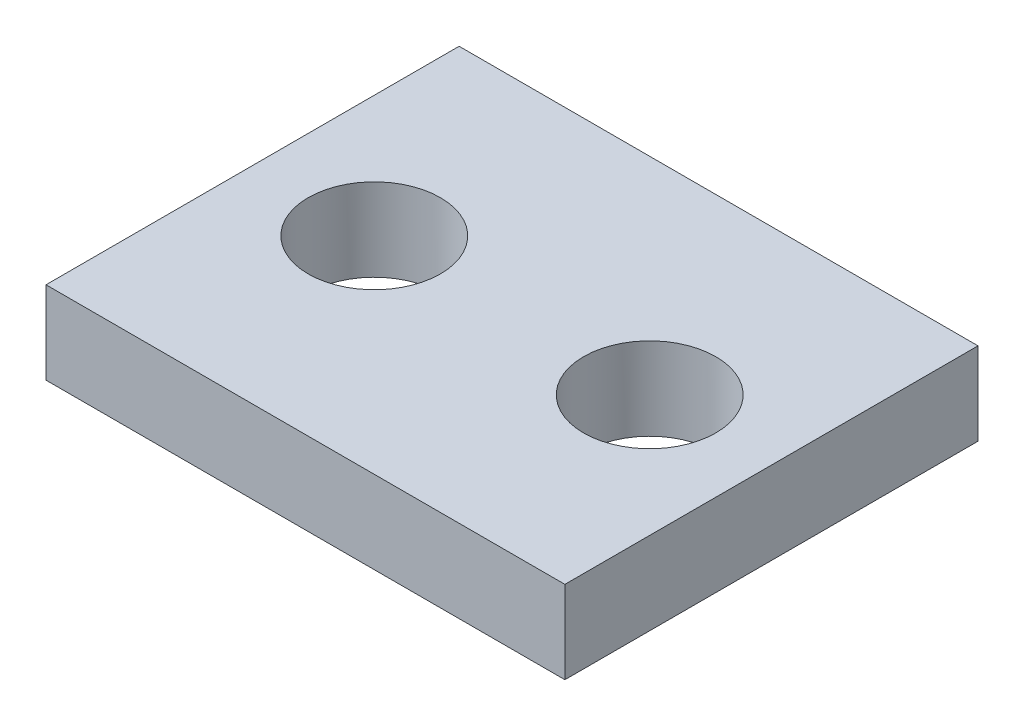
ISO-10303-21;
HEADER;
FILE_DESCRIPTION(('STEP AP214'),'2;1');
FILE_NAME('part.step','',(''),(''),'','','');
FILE_SCHEMA(('AUTOMOTIVE_DESIGN { 1 0 10303 214 1 1 1 1 }'));
ENDSEC;
DATA;
#1=APPLICATION_CONTEXT('core data for automotive mechanical design processes');
#2=APPLICATION_PROTOCOL_DEFINITION('international standard','automotive_design',2000,#1);
#3=PRODUCT_CONTEXT('',#1,'mechanical');
#4=PRODUCT('Part','Part','',(#3));
#5=PRODUCT_RELATED_PRODUCT_CATEGORY('part','',(#4));
#6=PRODUCT_DEFINITION_FORMATION('','',#4);
#7=PRODUCT_DEFINITION_CONTEXT('part definition',#1,'design');
#8=PRODUCT_DEFINITION('design','',#6,#7);
#9=PRODUCT_DEFINITION_SHAPE('','',#8);
#10=(LENGTH_UNIT() NAMED_UNIT(*) SI_UNIT(.MILLI.,.METRE.));
#11=(NAMED_UNIT(*) PLANE_ANGLE_UNIT() SI_UNIT($,.RADIAN.));
#12=(NAMED_UNIT(*) SI_UNIT($,.STERADIAN.) SOLID_ANGLE_UNIT());
#13=UNCERTAINTY_MEASURE_WITH_UNIT(LENGTH_MEASURE(1.E-05),#10,'distance_accuracy_value','');
#14=(GEOMETRIC_REPRESENTATION_CONTEXT(3) GLOBAL_UNCERTAINTY_ASSIGNED_CONTEXT((#13)) GLOBAL_UNIT_ASSIGNED_CONTEXT((#10,
#11,#12)) REPRESENTATION_CONTEXT('',''));
#15=CARTESIAN_POINT('',(0.,0.,0.));
#16=DIRECTION('',(0.,0.,1.));
#17=DIRECTION('',(1.,0.,0.));
#18=AXIS2_PLACEMENT_3D('',#15,#16,#17);
#19=CARTESIAN_POINT('',(9.42,3.,7.5));
#20=DIRECTION('',(-1.,0.,0.));
#21=DIRECTION('',(0.,0.,1.));
#22=AXIS2_PLACEMENT_3D('',#19,#20,#21);
#23=PLANE('',#22);
#24=DIRECTION('',(0.,0.,-1.));
#25=VECTOR('',#24,1.);
#26=CARTESIAN_POINT('',(9.42,0.,7.5));
#27=LINE('',#26,#25);
#28=CARTESIAN_POINT('',(9.42,0.,7.5));
#29=VERTEX_POINT('',#28);
#30=CARTESIAN_POINT('',(9.42,0.,-7.5));
#31=VERTEX_POINT('',#30);
#32=EDGE_CURVE('E96',#29,#31,#27,.T.);
#33=ORIENTED_EDGE('',*,*,#32,.T.);
#34=DIRECTION('',(0.,-1.,0.));
#35=VECTOR('',#34,1.);
#36=CARTESIAN_POINT('',(9.42,3.,-7.5));
#37=LINE('',#36,#35);
#38=CARTESIAN_POINT('',(9.42,3.,-7.5));
#39=VERTEX_POINT('',#38);
#40=EDGE_CURVE('E11',#39,#31,#37,.T.);
#41=ORIENTED_EDGE('',*,*,#40,.F.);
#42=DIRECTION('',(0.,0.,-1.));
#43=VECTOR('',#42,1.);
#44=CARTESIAN_POINT('',(9.42,3.,7.5));
#45=LINE('',#44,#43);
#46=CARTESIAN_POINT('',(9.42,3.,7.5));
#47=VERTEX_POINT('',#46);
#48=EDGE_CURVE('E84',#47,#39,#45,.T.);
#49=ORIENTED_EDGE('',*,*,#48,.F.);
#50=DIRECTION('',(0.,-1.,0.));
#51=VECTOR('',#50,1.);
#52=CARTESIAN_POINT('',(9.42,3.,7.5));
#53=LINE('',#52,#51);
#54=EDGE_CURVE('E92',#47,#29,#53,.T.);
#55=ORIENTED_EDGE('',*,*,#54,.T.);
#56=EDGE_LOOP('',(#33,#41,#49,#55));
#57=FACE_BOUND('',#56,.T.);
#58=ADVANCED_FACE('F33',(#57),#23,.F.);
#59=CARTESIAN_POINT('',(-9.42,3.,-7.5));
#60=DIRECTION('',(0.,0.,1.));
#61=DIRECTION('',(1.,0.,0.));
#62=AXIS2_PLACEMENT_3D('',#59,#60,#61);
#63=PLANE('',#62);
#64=DIRECTION('',(-1.,0.,0.));
#65=VECTOR('',#64,1.);
#66=CARTESIAN_POINT('',(-9.42,0.,-7.5));
#67=LINE('',#66,#65);
#68=CARTESIAN_POINT('',(-9.42,0.,-7.5));
#69=VERTEX_POINT('',#68);
#70=EDGE_CURVE('E88',#31,#69,#67,.T.);
#71=ORIENTED_EDGE('',*,*,#70,.T.);
#72=DIRECTION('',(0.,-1.,0.));
#73=VECTOR('',#72,1.);
#74=CARTESIAN_POINT('',(-9.42,3.,-7.5));
#75=LINE('',#74,#73);
#76=CARTESIAN_POINT('',(-9.42,3.,-7.5));
#77=VERTEX_POINT('',#76);
#78=EDGE_CURVE('E41',#77,#69,#75,.T.);
#79=ORIENTED_EDGE('',*,*,#78,.F.);
#80=DIRECTION('',(-1.,0.,0.));
#81=VECTOR('',#80,1.);
#82=CARTESIAN_POINT('',(-9.42,3.,-7.5));
#83=LINE('',#82,#81);
#84=EDGE_CURVE('E79',#39,#77,#83,.T.);
#85=ORIENTED_EDGE('',*,*,#84,.F.);
#86=ORIENTED_EDGE('',*,*,#40,.T.);
#87=EDGE_LOOP('',(#71,#79,#85,#86));
#88=FACE_BOUND('',#87,.T.);
#89=ADVANCED_FACE('F87',(#88),#63,.F.);
#90=CARTESIAN_POINT('',(-9.42,3.,7.5));
#91=DIRECTION('',(1.,0.,0.));
#92=DIRECTION('',(0.,0.,-1.));
#93=AXIS2_PLACEMENT_3D('',#90,#91,#92);
#94=PLANE('',#93);
#95=DIRECTION('',(0.,0.,1.));
#96=VECTOR('',#95,1.);
#97=CARTESIAN_POINT('',(-9.42,0.,7.5));
#98=LINE('',#97,#96);
#99=CARTESIAN_POINT('',(-9.42,0.,7.5));
#100=VERTEX_POINT('',#99);
#101=EDGE_CURVE('E66',#69,#100,#98,.T.);
#102=ORIENTED_EDGE('',*,*,#101,.T.);
#103=DIRECTION('',(0.,-1.,0.));
#104=VECTOR('',#103,1.);
#105=CARTESIAN_POINT('',(-9.42,3.,7.5));
#106=LINE('',#105,#104);
#107=CARTESIAN_POINT('',(-9.42,3.,7.5));
#108=VERTEX_POINT('',#107);
#109=EDGE_CURVE('E89',#108,#100,#106,.T.);
#110=ORIENTED_EDGE('',*,*,#109,.F.);
#111=DIRECTION('',(0.,0.,1.));
#112=VECTOR('',#111,1.);
#113=CARTESIAN_POINT('',(-9.42,3.,7.5));
#114=LINE('',#113,#112);
#115=EDGE_CURVE('E82',#77,#108,#114,.T.);
#116=ORIENTED_EDGE('',*,*,#115,.F.);
#117=ORIENTED_EDGE('',*,*,#78,.T.);
#118=EDGE_LOOP('',(#102,#110,#116,#117));
#119=FACE_BOUND('',#118,.T.);
#120=ADVANCED_FACE('F90',(#119),#94,.F.);
#121=CARTESIAN_POINT('',(-9.42,3.,7.5));
#122=DIRECTION('',(0.,0.,-1.));
#123=DIRECTION('',(-1.,0.,0.));
#124=AXIS2_PLACEMENT_3D('',#121,#122,#123);
#125=PLANE('',#124);
#126=DIRECTION('',(1.,0.,0.));
#127=VECTOR('',#126,1.);
#128=CARTESIAN_POINT('',(-9.42,0.,7.5));
#129=LINE('',#128,#127);
#130=EDGE_CURVE('E72',#100,#29,#129,.T.);
#131=ORIENTED_EDGE('',*,*,#130,.T.);
#132=ORIENTED_EDGE('',*,*,#54,.F.);
#133=DIRECTION('',(1.,0.,0.));
#134=VECTOR('',#133,1.);
#135=CARTESIAN_POINT('',(-9.42,3.,7.5));
#136=LINE('',#135,#134);
#137=EDGE_CURVE('E49',#108,#47,#136,.T.);
#138=ORIENTED_EDGE('',*,*,#137,.F.);
#139=ORIENTED_EDGE('',*,*,#109,.T.);
#140=EDGE_LOOP('',(#131,#132,#138,#139));
#141=FACE_BOUND('',#140,.T.);
#142=ADVANCED_FACE('F104',(#141),#125,.F.);
#143=CARTESIAN_POINT('',(0.,3.,0.));
#144=DIRECTION('',(0.,-1.,0.));
#145=DIRECTION('',(0.,0.,-1.));
#146=AXIS2_PLACEMENT_3D('',#143,#144,#145);
#147=PLANE('',#146);
#148=CARTESIAN_POINT('',(5.,3.,0.));
#149=DIRECTION('',(0.,-1.,0.));
#150=DIRECTION('',(0.,0.,-1.));
#151=AXIS2_PLACEMENT_3D('',#148,#149,#150);
#152=CIRCLE('',#151,2.4);
#153=CARTESIAN_POINT('',(5.,3.,-2.4));
#154=VERTEX_POINT('',#153);
#155=EDGE_CURVE('E115',#154,#154,#152,.F.);
#156=ORIENTED_EDGE('',*,*,#155,.F.);
#157=EDGE_LOOP('',(#156));
#158=FACE_BOUND('',#157,.T.);
#159=CARTESIAN_POINT('',(-5.,3.,0.));
#160=DIRECTION('',(0.,-1.,0.));
#161=DIRECTION('',(0.,0.,-1.));
#162=AXIS2_PLACEMENT_3D('',#159,#160,#161);
#163=CIRCLE('',#162,2.4);
#164=CARTESIAN_POINT('',(-5.,3.,-2.4));
#165=VERTEX_POINT('',#164);
#166=EDGE_CURVE('E99',#165,#165,#163,.T.);
#167=ORIENTED_EDGE('',*,*,#166,.T.);
#168=EDGE_LOOP('',(#167));
#169=FACE_BOUND('',#168,.T.);
#170=ORIENTED_EDGE('',*,*,#48,.T.);
#171=ORIENTED_EDGE('',*,*,#84,.T.);
#172=ORIENTED_EDGE('',*,*,#115,.T.);
#173=ORIENTED_EDGE('',*,*,#137,.T.);
#174=EDGE_LOOP('',(#170,#171,#172,#173));
#175=FACE_BOUND('',#174,.T.);
#176=ADVANCED_FACE('F80',(#158,#169,#175),#147,.F.);
#177=CARTESIAN_POINT('',(0.,0.,0.));
#178=DIRECTION('',(0.,-1.,0.));
#179=DIRECTION('',(0.,0.,-1.));
#180=AXIS2_PLACEMENT_3D('',#177,#178,#179);
#181=PLANE('',#180);
#182=CARTESIAN_POINT('',(5.,0.,0.));
#183=DIRECTION('',(0.,-1.,0.));
#184=DIRECTION('',(0.,0.,1.));
#185=AXIS2_PLACEMENT_3D('',#182,#183,#184);
#186=CIRCLE('',#185,2.4);
#187=CARTESIAN_POINT('',(5.,0.,2.4));
#188=VERTEX_POINT('',#187);
#189=EDGE_CURVE('E118',#188,#188,#186,.T.);
#190=ORIENTED_EDGE('',*,*,#189,.F.);
#191=EDGE_LOOP('',(#190));
#192=FACE_BOUND('',#191,.T.);
#193=CARTESIAN_POINT('',(-5.,0.,0.));
#194=DIRECTION('',(0.,1.,0.));
#195=DIRECTION('',(0.,0.,1.));
#196=AXIS2_PLACEMENT_3D('',#193,#194,#195);
#197=CIRCLE('',#196,2.4);
#198=CARTESIAN_POINT('',(-5.,0.,2.4));
#199=VERTEX_POINT('',#198);
#200=EDGE_CURVE('E112',#199,#199,#197,.T.);
#201=ORIENTED_EDGE('',*,*,#200,.T.);
#202=EDGE_LOOP('',(#201));
#203=FACE_BOUND('',#202,.T.);
#204=ORIENTED_EDGE('',*,*,#32,.F.);
#205=ORIENTED_EDGE('',*,*,#130,.F.);
#206=ORIENTED_EDGE('',*,*,#101,.F.);
#207=ORIENTED_EDGE('',*,*,#70,.F.);
#208=EDGE_LOOP('',(#204,#205,#206,#207));
#209=FACE_BOUND('',#208,.T.);
#210=ADVANCED_FACE('F107',(#192,#203,#209),#181,.T.);
#211=CARTESIAN_POINT('',(-5.,0.,0.));
#212=DIRECTION('',(0.,1.,0.));
#213=DIRECTION('',(0.,0.,1.));
#214=AXIS2_PLACEMENT_3D('',#211,#212,#213);
#215=CYLINDRICAL_SURFACE('',#214,2.4);
#216=ORIENTED_EDGE('',*,*,#200,.F.);
#217=EDGE_LOOP('',(#216));
#218=FACE_BOUND('',#217,.T.);
#219=ORIENTED_EDGE('',*,*,#166,.F.);
#220=EDGE_LOOP('',(#219));
#221=FACE_BOUND('',#220,.T.);
#222=ADVANCED_FACE('F127',(#218,#221),#215,.F.);
#223=CARTESIAN_POINT('',(5.,0.,0.));
#224=DIRECTION('',(0.,1.,0.));
#225=DIRECTION('',(0.,0.,1.));
#226=AXIS2_PLACEMENT_3D('',#223,#224,#225);
#227=CYLINDRICAL_SURFACE('',#226,2.4);
#228=ORIENTED_EDGE('',*,*,#189,.T.);
#229=EDGE_LOOP('',(#228));
#230=FACE_BOUND('',#229,.T.);
#231=ORIENTED_EDGE('',*,*,#155,.T.);
#232=EDGE_LOOP('',(#231));
#233=FACE_BOUND('',#232,.T.);
#234=ADVANCED_FACE('F122',(#230,#233),#227,.F.);
#235=CLOSED_SHELL('',(#58,#89,#120,#142,#176,#210,#222,#234));
#236=MANIFOLD_SOLID_BREP('B2',#235);
#237=ADVANCED_BREP_SHAPE_REPRESENTATION('',(#18,#236),#14);
#238=SHAPE_DEFINITION_REPRESENTATION(#9,#237);
ENDSEC;
END-ISO-10303-21;
